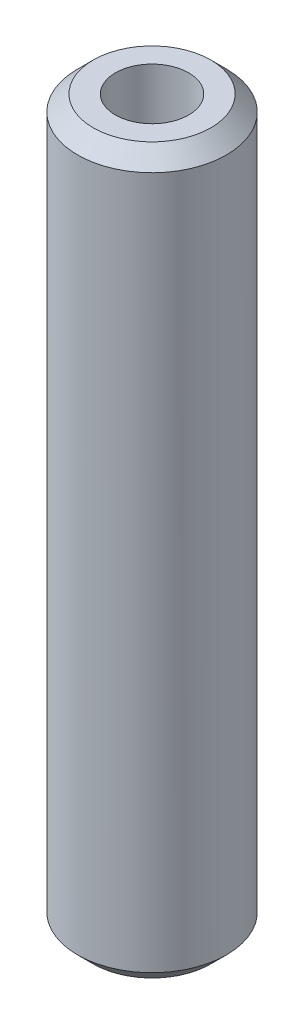
ISO-10303-21;
HEADER;
FILE_DESCRIPTION(('STEP AP214'),'2;1');
FILE_NAME('part.step','',(''),(''),'','','');
FILE_SCHEMA(('AUTOMOTIVE_DESIGN { 1 0 10303 214 1 1 1 1 }'));
ENDSEC;
DATA;
#1=APPLICATION_CONTEXT('core data for automotive mechanical design processes');
#2=APPLICATION_PROTOCOL_DEFINITION('international standard','automotive_design',2000,#1);
#3=PRODUCT_CONTEXT('',#1,'mechanical');
#4=PRODUCT('Part','Part','',(#3));
#5=PRODUCT_RELATED_PRODUCT_CATEGORY('part','',(#4));
#6=PRODUCT_DEFINITION_FORMATION('','',#4);
#7=PRODUCT_DEFINITION_CONTEXT('part definition',#1,'design');
#8=PRODUCT_DEFINITION('design','',#6,#7);
#9=PRODUCT_DEFINITION_SHAPE('','',#8);
#10=(LENGTH_UNIT() NAMED_UNIT(*) SI_UNIT(.MILLI.,.METRE.));
#11=(NAMED_UNIT(*) PLANE_ANGLE_UNIT() SI_UNIT($,.RADIAN.));
#12=(NAMED_UNIT(*) SI_UNIT($,.STERADIAN.) SOLID_ANGLE_UNIT());
#13=UNCERTAINTY_MEASURE_WITH_UNIT(LENGTH_MEASURE(1.E-05),#10,'distance_accuracy_value','');
#14=(GEOMETRIC_REPRESENTATION_CONTEXT(3) GLOBAL_UNCERTAINTY_ASSIGNED_CONTEXT((#13)) GLOBAL_UNIT_ASSIGNED_CONTEXT((#10,
#11,#12)) REPRESENTATION_CONTEXT('',''));
#15=CARTESIAN_POINT('',(0.,0.,0.));
#16=DIRECTION('',(0.,0.,1.));
#17=DIRECTION('',(1.,0.,0.));
#18=AXIS2_PLACEMENT_3D('',#15,#16,#17);
#19=CARTESIAN_POINT('',(0.,243.162077867844,0.));
#20=DIRECTION('',(0.,-1.,0.));
#21=DIRECTION('',(0.,0.,-1.));
#22=AXIS2_PLACEMENT_3D('',#19,#20,#21);
#23=CYLINDRICAL_SURFACE('',#22,25.);
#24=CARTESIAN_POINT('',(0.,237.901911164273,0.));
#25=DIRECTION('',(0.,1.,0.));
#26=DIRECTION('',(0.,0.,1.));
#27=AXIS2_PLACEMENT_3D('',#24,#25,#26);
#28=CIRCLE('',#27,25.);
#29=CARTESIAN_POINT('',(0.,237.901911164273,-25.));
#30=VERTEX_POINT('',#29);
#31=EDGE_CURVE('E50',#30,#30,#28,.F.);
#32=CARTESIAN_POINT('',(0.,5.26016670357113,0.));
#33=DIRECTION('',(0.,1.,0.));
#34=DIRECTION('',(0.,0.,1.));
#35=AXIS2_PLACEMENT_3D('',#32,#33,#34);
#36=CIRCLE('',#35,25.);
#37=CARTESIAN_POINT('',(0.,5.2601667035711,-25.));
#38=VERTEX_POINT('',#37);
#39=EDGE_CURVE('E51',#38,#38,#36,.T.);
#40=CARTESIAN_POINT('',(0.,237.901911164273,-25.));
#41=CARTESIAN_POINT('',(0.,235.478559659474,-25.));
#42=CARTESIAN_POINT('',(0.,233.055208154675,-25.));
#43=CARTESIAN_POINT('',(0.,228.208505145077,-25.));
#44=CARTESIAN_POINT('',(0.,225.785153640278,-25.));
#45=CARTESIAN_POINT('',(0.,220.93845063068,-25.));
#46=CARTESIAN_POINT('',(0.,218.515099125881,-25.));
#47=CARTESIAN_POINT('',(0.,213.668396116283,-25.));
#48=CARTESIAN_POINT('',(0.,211.245044611484,-25.));
#49=CARTESIAN_POINT('',(0.,206.398341601887,-25.));
#50=CARTESIAN_POINT('',(0.,203.974990097087,-25.));
#51=CARTESIAN_POINT('',(0.,199.12828708749,-25.));
#52=CARTESIAN_POINT('',(0.,196.704935582691,-25.));
#53=CARTESIAN_POINT('',(0.,191.858232573093,-25.));
#54=CARTESIAN_POINT('',(0.,189.434881068294,-25.));
#55=CARTESIAN_POINT('',(0.,184.588178058696,-25.));
#56=CARTESIAN_POINT('',(0.,182.164826553897,-25.));
#57=CARTESIAN_POINT('',(0.,177.318123544299,-25.));
#58=CARTESIAN_POINT('',(0.,174.8947720395,-25.));
#59=CARTESIAN_POINT('',(0.,170.048069029902,-25.));
#60=CARTESIAN_POINT('',(0.,167.624717525103,-25.));
#61=CARTESIAN_POINT('',(0.,162.778014515505,-25.));
#62=CARTESIAN_POINT('',(0.,160.354663010706,-25.));
#63=CARTESIAN_POINT('',(0.,155.507960001108,-25.));
#64=CARTESIAN_POINT('',(0.,153.084608496309,-25.));
#65=CARTESIAN_POINT('',(0.,148.237905486711,-25.));
#66=CARTESIAN_POINT('',(0.,145.814553981912,-25.));
#67=CARTESIAN_POINT('',(0.,140.967850972314,-25.));
#68=CARTESIAN_POINT('',(0.,138.544499467515,-25.));
#69=CARTESIAN_POINT('',(0.,133.697796457917,-25.));
#70=CARTESIAN_POINT('',(0.,131.274444953118,-25.));
#71=CARTESIAN_POINT('',(0.,126.42774194352,-25.));
#72=CARTESIAN_POINT('',(0.,124.004390438721,-25.));
#73=CARTESIAN_POINT('',(0.,119.157687429123,-25.));
#74=CARTESIAN_POINT('',(0.,116.734335924324,-25.));
#75=CARTESIAN_POINT('',(0.,111.887632914726,-25.));
#76=CARTESIAN_POINT('',(0.,109.464281409927,-25.));
#77=CARTESIAN_POINT('',(0.,104.617578400329,-25.));
#78=CARTESIAN_POINT('',(0.,102.19422689553,-25.));
#79=CARTESIAN_POINT('',(0.,97.3475238859324,-25.));
#80=CARTESIAN_POINT('',(0.,94.9241723811334,-25.));
#81=CARTESIAN_POINT('',(0.,90.0774693715354,-25.));
#82=CARTESIAN_POINT('',(0.,87.6541178667364,-25.));
#83=CARTESIAN_POINT('',(0.,82.8074148571385,-25.));
#84=CARTESIAN_POINT('',(0.,80.3840633523395,-25.));
#85=CARTESIAN_POINT('',(0.,75.5373603427415,-25.));
#86=CARTESIAN_POINT('',(0.,73.1140088379425,-25.));
#87=CARTESIAN_POINT('',(0.,68.2673058283446,-25.));
#88=CARTESIAN_POINT('',(0.,65.8439543235456,-25.));
#89=CARTESIAN_POINT('',(0.,60.9972513139476,-25.));
#90=CARTESIAN_POINT('',(0.,58.5738998091487,-25.));
#91=CARTESIAN_POINT('',(0.,53.7271967995507,-25.));
#92=CARTESIAN_POINT('',(0.,51.3038452947517,-25.));
#93=CARTESIAN_POINT('',(0.,46.4571422851538,-25.));
#94=CARTESIAN_POINT('',(0.,44.0337907803548,-25.));
#95=CARTESIAN_POINT('',(0.,39.1870877707568,-25.));
#96=CARTESIAN_POINT('',(0.,36.7637362659578,-25.));
#97=CARTESIAN_POINT('',(0.,31.9170332563599,-25.));
#98=CARTESIAN_POINT('',(0.,29.4936817515609,-25.));
#99=CARTESIAN_POINT('',(0.,24.6469787419629,-25.));
#100=CARTESIAN_POINT('',(0.,22.223627237164,-25.));
#101=CARTESIAN_POINT('',(0.,17.376924227566,-25.));
#102=CARTESIAN_POINT('',(0.,14.953572722767,-25.));
#103=CARTESIAN_POINT('',(0.,10.1068697131691,-25.));
#104=CARTESIAN_POINT('',(0.,7.68351820837008,-25.));
#105=CARTESIAN_POINT('',(0.,5.2601667035711,-25.));
#106=B_SPLINE_CURVE_WITH_KNOTS('',3,(#40,#41,#42,#43,#44,#45,#46,#47,#48,#49,#50,#51,#52,#53,
#54,#55,#56,#57,#58,#59,#60,#61,#62,#63,#64,#65,#66,#67,#68,#69,#70,#71,#72,#73,#74,#75,#76,#77,
#78,#79,#80,#81,#82,#83,#84,#85,#86,#87,#88,#89,#90,#91,#92,#93,#94,#95,#96,#97,#98,#99,#100,
#101,#102,#103,#104,#105),.UNSPECIFIED.,.F.,.F.,(4,2,2,2,2,2,2,2,2,2,2,2,2,2,2,2,2,2,2,2,2,2,2,
2,2,2,2,2,2,2,2,2,4),(0.,7.27005451439697,14.5401090287939,21.8101635431908,29.0802180575878,
36.3502725719847,43.6203270863817,50.8903816007786,58.1604361151755,65.4304906295725,
72.7005451439694,79.9705996583664,87.2406541727633,94.5107086871602,101.780763201557,
109.050817715954,116.320872230351,123.590926744748,130.860981259145,138.131035773542,
145.401090287939,152.671144802336,159.941199316733,167.21125383113,174.481308345527,
181.751362859924,189.021417374321,196.291471888717,203.561526403114,210.831580917511,
218.101635431908,225.371689946305,232.641744460702),.UNSPECIFIED.);
#107=EDGE_CURVE('BSEAM39',#30,#38,#106,.T.);
#108=ORIENTED_EDGE('',*,*,#31,.T.);
#109=ORIENTED_EDGE('',*,*,#39,.T.);
#110=ORIENTED_EDGE('',*,*,#107,.T.);
#111=ORIENTED_EDGE('',*,*,#107,.F.);
#112=EDGE_LOOP('',(#108,#110,#109,#111));
#113=FACE_BOUND('',#112,.T.);
#114=ADVANCED_FACE('F39',(#113),#23,.T.);
#115=CARTESIAN_POINT('',(0.,243.162077867844,0.));
#116=DIRECTION('',(0.,1.,0.));
#117=DIRECTION('',(0.,0.,1.));
#118=AXIS2_PLACEMENT_3D('',#115,#116,#117);
#119=PLANE('',#118);
#120=CARTESIAN_POINT('',(0.,243.162077867844,0.));
#121=DIRECTION('',(0.,1.,0.));
#122=DIRECTION('',(0.,0.,1.));
#123=AXIS2_PLACEMENT_3D('',#120,#121,#122);
#124=CIRCLE('',#123,19.7398332964291);
#125=CARTESIAN_POINT('',(0.,243.162077867844,19.7398332964291));
#126=VERTEX_POINT('',#125);
#127=EDGE_CURVE('E54',#126,#126,#124,.T.);
#128=ORIENTED_EDGE('',*,*,#127,.T.);
#129=EDGE_LOOP('',(#128));
#130=FACE_BOUND('',#129,.T.);
#131=CARTESIAN_POINT('',(0.,243.162077867844,0.));
#132=DIRECTION('',(0.,1.,0.));
#133=DIRECTION('',(0.,0.,1.));
#134=AXIS2_PLACEMENT_3D('',#131,#132,#133);
#135=CIRCLE('',#134,12.287884458193);
#136=CARTESIAN_POINT('',(0.,243.162077867844,-12.287884458193));
#137=VERTEX_POINT('',#136);
#138=EDGE_CURVE('E58',#137,#137,#135,.T.);
#139=ORIENTED_EDGE('',*,*,#138,.F.);
#140=EDGE_LOOP('',(#139));
#141=FACE_BOUND('',#140,.T.);
#142=ADVANCED_FACE('F69',(#130,#141),#119,.T.);
#143=CARTESIAN_POINT('',(0.,0.,0.));
#144=DIRECTION('',(0.,1.,0.));
#145=DIRECTION('',(0.,0.,1.));
#146=AXIS2_PLACEMENT_3D('',#143,#144,#145);
#147=PLANE('',#146);
#148=CARTESIAN_POINT('',(0.,0.,0.));
#149=DIRECTION('',(0.,1.,0.));
#150=DIRECTION('',(0.,0.,1.));
#151=AXIS2_PLACEMENT_3D('',#148,#149,#150);
#152=CIRCLE('',#151,19.7398332964288);
#153=CARTESIAN_POINT('',(0.,0.,19.7398332964288));
#154=VERTEX_POINT('',#153);
#155=EDGE_CURVE('E10',#154,#154,#152,.F.);
#156=ORIENTED_EDGE('',*,*,#155,.T.);
#157=EDGE_LOOP('',(#156));
#158=FACE_BOUND('',#157,.T.);
#159=CARTESIAN_POINT('',(0.,0.,0.));
#160=DIRECTION('',(0.,1.,0.));
#161=DIRECTION('',(0.,0.,1.));
#162=AXIS2_PLACEMENT_3D('',#159,#160,#161);
#163=CIRCLE('',#162,12.287884458193);
#164=CARTESIAN_POINT('',(0.,0.,-12.287884458193));
#165=VERTEX_POINT('',#164);
#166=EDGE_CURVE('E63',#165,#165,#163,.T.);
#167=ORIENTED_EDGE('',*,*,#166,.T.);
#168=EDGE_LOOP('',(#167));
#169=FACE_BOUND('',#168,.T.);
#170=ADVANCED_FACE('F75',(#158,#169),#147,.F.);
#171=CARTESIAN_POINT('',(0.,243.162077867844,0.));
#172=DIRECTION('',(0.,-1.,0.));
#173=DIRECTION('',(0.,0.,-1.));
#174=AXIS2_PLACEMENT_3D('',#171,#172,#173);
#175=CYLINDRICAL_SURFACE('',#174,12.287884458193);
#176=CARTESIAN_POINT('',(0.,243.162077867844,-12.287884458193));
#177=CARTESIAN_POINT('',(0.,240.629139556721,-12.287884458193));
#178=CARTESIAN_POINT('',(0.,238.096201245597,-12.287884458193));
#179=CARTESIAN_POINT('',(0.,233.030324623351,-12.287884458193));
#180=CARTESIAN_POINT('',(0.,230.497386312227,-12.287884458193));
#181=CARTESIAN_POINT('',(0.,225.43150968998,-12.287884458193));
#182=CARTESIAN_POINT('',(0.,222.898571378857,-12.287884458193));
#183=CARTESIAN_POINT('',(0.,217.83269475661,-12.287884458193));
#184=CARTESIAN_POINT('',(0.,215.299756445487,-12.287884458193));
#185=CARTESIAN_POINT('',(0.,210.23387982324,-12.287884458193));
#186=CARTESIAN_POINT('',(0.,207.700941512117,-12.287884458193));
#187=CARTESIAN_POINT('',(0.,202.63506488987,-12.287884458193));
#188=CARTESIAN_POINT('',(0.,200.102126578747,-12.287884458193));
#189=CARTESIAN_POINT('',(0.,195.0362499565,-12.287884458193));
#190=CARTESIAN_POINT('',(0.,192.503311645377,-12.287884458193));
#191=CARTESIAN_POINT('',(0.,187.43743502313,-12.287884458193));
#192=CARTESIAN_POINT('',(0.,184.904496712006,-12.287884458193));
#193=CARTESIAN_POINT('',(0.,179.83862008976,-12.287884458193));
#194=CARTESIAN_POINT('',(0.,177.305681778636,-12.287884458193));
#195=CARTESIAN_POINT('',(0.,172.23980515639,-12.287884458193));
#196=CARTESIAN_POINT('',(0.,169.706866845266,-12.287884458193));
#197=CARTESIAN_POINT('',(0.,164.640990223019,-12.287884458193));
#198=CARTESIAN_POINT('',(0.,162.108051911896,-12.287884458193));
#199=CARTESIAN_POINT('',(0.,157.042175289649,-12.287884458193));
#200=CARTESIAN_POINT('',(0.,154.509236978526,-12.287884458193));
#201=CARTESIAN_POINT('',(0.,149.443360356279,-12.287884458193));
#202=CARTESIAN_POINT('',(0.,146.910422045156,-12.287884458193));
#203=CARTESIAN_POINT('',(0.,141.844545422909,-12.287884458193));
#204=CARTESIAN_POINT('',(0.,139.311607111786,-12.287884458193));
#205=CARTESIAN_POINT('',(0.,134.245730489539,-12.287884458193));
#206=CARTESIAN_POINT('',(0.,131.712792178416,-12.287884458193));
#207=CARTESIAN_POINT('',(0.,126.646915556169,-12.287884458193));
#208=CARTESIAN_POINT('',(0.,124.113977245045,-12.287884458193));
#209=CARTESIAN_POINT('',(0.,119.048100622799,-12.287884458193));
#210=CARTESIAN_POINT('',(0.,116.515162311675,-12.287884458193));
#211=CARTESIAN_POINT('',(0.,111.449285689429,-12.287884458193));
#212=CARTESIAN_POINT('',(0.,108.916347378305,-12.287884458193));
#213=CARTESIAN_POINT('',(0.,103.850470756058,-12.287884458193));
#214=CARTESIAN_POINT('',(0.,101.317532444935,-12.287884458193));
#215=CARTESIAN_POINT('',(0.,96.2516558226883,-12.287884458193));
#216=CARTESIAN_POINT('',(0.,93.7187175115649,-12.287884458193));
#217=CARTESIAN_POINT('',(0.,88.6528408893182,-12.287884458193));
#218=CARTESIAN_POINT('',(0.,86.1199025781948,-12.287884458193));
#219=CARTESIAN_POINT('',(0.,81.0540259559481,-12.287884458193));
#220=CARTESIAN_POINT('',(0.,78.5210876448247,-12.287884458193));
#221=CARTESIAN_POINT('',(0.,73.4552110225779,-12.287884458193));
#222=CARTESIAN_POINT('',(0.,70.9222727114545,-12.287884458193));
#223=CARTESIAN_POINT('',(0.,65.8563960892078,-12.287884458193));
#224=CARTESIAN_POINT('',(0.,63.3234577780844,-12.287884458193));
#225=CARTESIAN_POINT('',(0.,58.2575811558377,-12.287884458193));
#226=CARTESIAN_POINT('',(0.,55.7246428447143,-12.287884458193));
#227=CARTESIAN_POINT('',(0.,50.6587662224675,-12.287884458193));
#228=CARTESIAN_POINT('',(0.,48.1258279113442,-12.287884458193));
#229=CARTESIAN_POINT('',(0.,43.0599512890974,-12.287884458193));
#230=CARTESIAN_POINT('',(0.,40.527012977974,-12.287884458193));
#231=CARTESIAN_POINT('',(0.,35.4611363557273,-12.287884458193));
#232=CARTESIAN_POINT('',(0.,32.9281980446039,-12.287884458193));
#233=CARTESIAN_POINT('',(0.,27.8623214223571,-12.287884458193));
#234=CARTESIAN_POINT('',(0.,25.3293831112338,-12.287884458193));
#235=CARTESIAN_POINT('',(0.,20.263506488987,-12.287884458193));
#236=CARTESIAN_POINT('',(0.,17.7305681778636,-12.287884458193));
#237=CARTESIAN_POINT('',(0.,12.6646915556169,-12.287884458193));
#238=CARTESIAN_POINT('',(0.,10.1317532444935,-12.287884458193));
#239=CARTESIAN_POINT('',(0.,5.06587662224676,-12.287884458193));
#240=CARTESIAN_POINT('',(0.,2.53293831112338,-12.287884458193));
#241=CARTESIAN_POINT('',(0.,0.,-12.287884458193));
#242=B_SPLINE_CURVE_WITH_KNOTS('',3,(#176,#177,#178,#179,#180,#181,#182,#183,#184,#185,#186,
#187,#188,#189,#190,#191,#192,#193,#194,#195,#196,#197,#198,#199,#200,#201,#202,#203,#204,#205,
#206,#207,#208,#209,#210,#211,#212,#213,#214,#215,#216,#217,#218,#219,#220,#221,#222,#223,#224,
#225,#226,#227,#228,#229,#230,#231,#232,#233,#234,#235,#236,#237,#238,#239,#240,#241),
.UNSPECIFIED.,.F.,.F.,(4,2,2,2,2,2,2,2,2,2,2,2,2,2,2,2,2,2,2,2,2,2,2,2,2,2,2,2,2,2,2,2,4),(0.,
7.59881493337011,15.1976298667403,22.7964448001104,30.3952597334805,37.9940746668506,
45.5928896002208,53.1917045335909,60.790519466961,68.3893344003311,75.9881493337013,
83.5869642670714,91.1857792004415,98.7845941338116,106.383409067182,113.982224000552,
121.581038933922,129.179853867292,136.778668800662,144.377483734032,151.976298667403,
159.575113600773,167.173928534143,174.772743467513,182.371558400883,189.970373334253,
197.569188267623,205.168003200993,212.766818134364,220.365633067734,227.964448001104,
235.563262934474,243.162077867844),.UNSPECIFIED.);
#243=EDGE_CURVE('BSEAM70',#137,#165,#242,.T.);
#244=ORIENTED_EDGE('',*,*,#138,.T.);
#245=ORIENTED_EDGE('',*,*,#166,.F.);
#246=ORIENTED_EDGE('',*,*,#243,.T.);
#247=ORIENTED_EDGE('',*,*,#243,.F.);
#248=EDGE_LOOP('',(#244,#246,#245,#247));
#249=FACE_BOUND('',#248,.T.);
#250=ADVANCED_FACE('F70',(#249),#175,.F.);
#251=CARTESIAN_POINT('',(0.,243.162077867844,0.));
#252=DIRECTION('',(0.,-1.,0.));
#253=DIRECTION('',(0.,0.,-1.));
#254=AXIS2_PLACEMENT_3D('',#251,#252,#253);
#255=CONICAL_SURFACE('',#254,19.7398332964291,0.78539816339745);
#256=ORIENTED_EDGE('',*,*,#31,.F.);
#257=EDGE_LOOP('',(#256));
#258=FACE_BOUND('',#257,.T.);
#259=ORIENTED_EDGE('',*,*,#127,.F.);
#260=EDGE_LOOP('',(#259));
#261=FACE_BOUND('',#260,.T.);
#262=ADVANCED_FACE('F81',(#258,#261),#255,.T.);
#263=CARTESIAN_POINT('',(0.,5.26016670357113,0.));
#264=DIRECTION('',(0.,1.,0.));
#265=DIRECTION('',(0.,0.,1.));
#266=AXIS2_PLACEMENT_3D('',#263,#264,#265);
#267=CONICAL_SURFACE('',#266,25.,0.785398163397452);
#268=ORIENTED_EDGE('',*,*,#155,.F.);
#269=EDGE_LOOP('',(#268));
#270=FACE_BOUND('',#269,.T.);
#271=ORIENTED_EDGE('',*,*,#39,.F.);
#272=EDGE_LOOP('',(#271));
#273=FACE_BOUND('',#272,.T.);
#274=ADVANCED_FACE('F45',(#270,#273),#267,.T.);
#275=CLOSED_SHELL('',(#114,#142,#170,#250,#262,#274));
#276=MANIFOLD_SOLID_BREP('B2',#275);
#277=ADVANCED_BREP_SHAPE_REPRESENTATION('',(#18,#276),#14);
#278=SHAPE_DEFINITION_REPRESENTATION(#9,#277);
ENDSEC;
END-ISO-10303-21;
